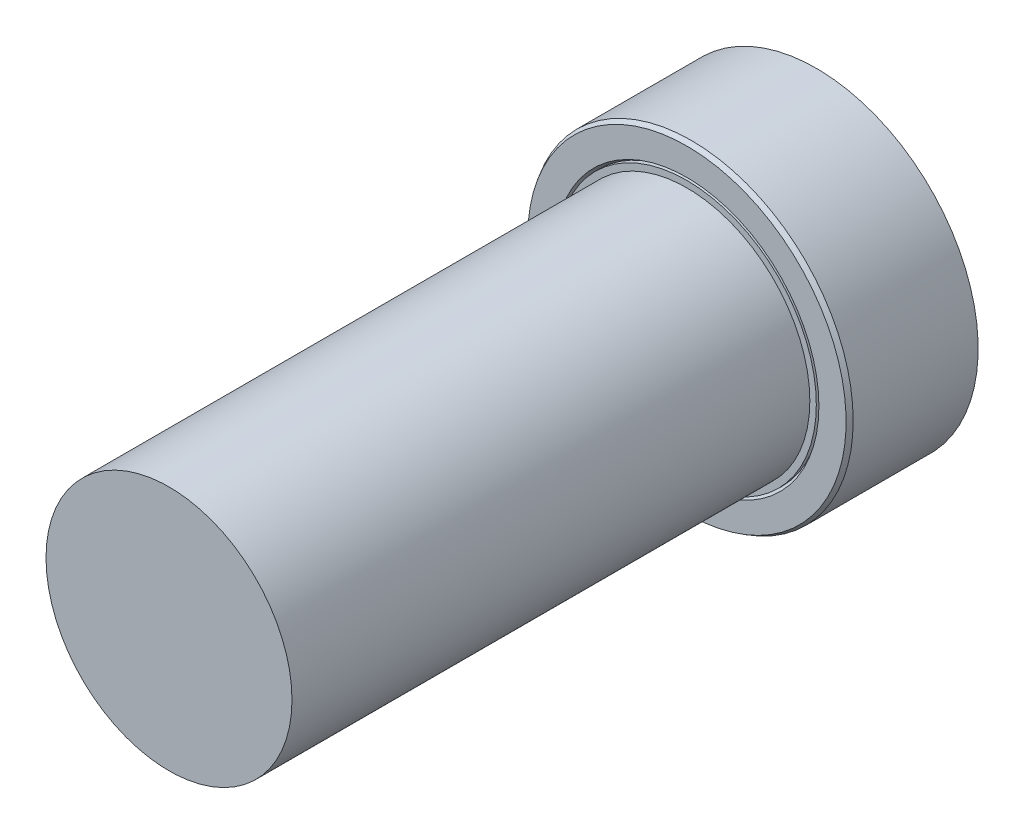
ISO-10303-21;
HEADER;
FILE_DESCRIPTION(('STEP AP214'),'2;1');
FILE_NAME('part.step','',(''),(''),'','','');
FILE_SCHEMA(('AUTOMOTIVE_DESIGN { 1 0 10303 214 1 1 1 1 }'));
ENDSEC;
DATA;
#1=APPLICATION_CONTEXT('core data for automotive mechanical design processes');
#2=APPLICATION_PROTOCOL_DEFINITION('international standard','automotive_design',2000,#1);
#3=PRODUCT_CONTEXT('',#1,'mechanical');
#4=PRODUCT('Part','Part','',(#3));
#5=PRODUCT_RELATED_PRODUCT_CATEGORY('part','',(#4));
#6=PRODUCT_DEFINITION_FORMATION('','',#4);
#7=PRODUCT_DEFINITION_CONTEXT('part definition',#1,'design');
#8=PRODUCT_DEFINITION('design','',#6,#7);
#9=PRODUCT_DEFINITION_SHAPE('','',#8);
#10=(LENGTH_UNIT() NAMED_UNIT(*) SI_UNIT(.MILLI.,.METRE.));
#11=(NAMED_UNIT(*) PLANE_ANGLE_UNIT() SI_UNIT($,.RADIAN.));
#12=(NAMED_UNIT(*) SI_UNIT($,.STERADIAN.) SOLID_ANGLE_UNIT());
#13=UNCERTAINTY_MEASURE_WITH_UNIT(LENGTH_MEASURE(1.E-05),#10,'distance_accuracy_value','');
#14=(GEOMETRIC_REPRESENTATION_CONTEXT(3) GLOBAL_UNCERTAINTY_ASSIGNED_CONTEXT((#13)) GLOBAL_UNIT_ASSIGNED_CONTEXT((#10,
#11,#12)) REPRESENTATION_CONTEXT('',''));
#15=CARTESIAN_POINT('',(0.,0.,0.));
#16=DIRECTION('',(0.,0.,1.));
#17=DIRECTION('',(1.,0.,0.));
#18=AXIS2_PLACEMENT_3D('',#15,#16,#17);
#19=CARTESIAN_POINT('',(0.,0.,1.22591498133671));
#20=DIRECTION('',(0.,0.,-1.));
#21=DIRECTION('',(-1.,0.,0.));
#22=AXIS2_PLACEMENT_3D('',#19,#20,#21);
#23=PLANE('',#22);
#24=CARTESIAN_POINT('',(0.,0.,1.22591498133671));
#25=DIRECTION('',(0.,0.,-1.));
#26=DIRECTION('',(-1.,0.,0.));
#27=AXIS2_PLACEMENT_3D('',#24,#25,#26);
#28=CIRCLE('',#27,6.25);
#29=CARTESIAN_POINT('',(-6.25,0.,1.22591498133671));
#30=VERTEX_POINT('',#29);
#31=EDGE_CURVE('E39',#30,#30,#28,.F.);
#32=ORIENTED_EDGE('',*,*,#31,.F.);
#33=EDGE_LOOP('',(#32));
#34=FACE_BOUND('',#33,.T.);
#35=ADVANCED_FACE('F36',(#34),#23,.T.);
#36=CARTESIAN_POINT('',(0.,0.,6.47591498133671));
#37=DIRECTION('',(0.,0.,-1.));
#38=DIRECTION('',(-1.,0.,0.));
#39=AXIS2_PLACEMENT_3D('',#36,#37,#38);
#40=CYLINDRICAL_SURFACE('',#39,6.25);
#41=ORIENTED_EDGE('',*,*,#31,.T.);
#42=EDGE_LOOP('',(#41));
#43=FACE_BOUND('',#42,.T.);
#44=CARTESIAN_POINT('',(0.,0.,6.0527099005798));
#45=DIRECTION('',(0.,0.,-1.));
#46=DIRECTION('',(1.,0.,0.));
#47=AXIS2_PLACEMENT_3D('',#44,#45,#46);
#48=CIRCLE('',#47,6.24999999999999);
#49=CARTESIAN_POINT('',(6.24999999999999,0.,6.0527099005798));
#50=VERTEX_POINT('',#49);
#51=EDGE_CURVE('E51',#50,#50,#48,.F.);
#52=ORIENTED_EDGE('',*,*,#51,.F.);
#53=EDGE_LOOP('',(#52));
#54=FACE_BOUND('',#53,.T.);
#55=ADVANCED_FACE('F69',(#43,#54),#40,.T.);
#56=CARTESIAN_POINT('',(0.,0.,6.0527099005798));
#57=DIRECTION('',(0.,0.,-1.));
#58=DIRECTION('',(-1.,0.,0.));
#59=AXIS2_PLACEMENT_3D('',#56,#57,#58);
#60=CONICAL_SURFACE('',#59,6.25,0.5235987755982);
#61=ORIENTED_EDGE('',*,*,#51,.T.);
#62=EDGE_LOOP('',(#61));
#63=FACE_BOUND('',#62,.T.);
#64=CARTESIAN_POINT('',(0.,0.,6.22591498133671));
#65=DIRECTION('',(0.,0.,-1.));
#66=DIRECTION('',(-1.,0.,0.));
#67=AXIS2_PLACEMENT_3D('',#64,#65,#66);
#68=CIRCLE('',#67,6.15000000000001);
#69=CARTESIAN_POINT('',(-6.15000000000001,0.,6.22591498133671));
#70=VERTEX_POINT('',#69);
#71=EDGE_CURVE('E59',#70,#70,#68,.T.);
#72=ORIENTED_EDGE('',*,*,#71,.T.);
#73=EDGE_LOOP('',(#72));
#74=FACE_BOUND('',#73,.T.);
#75=ADVANCED_FACE('F76',(#63,#74),#60,.T.);
#76=CARTESIAN_POINT('',(0.,0.,6.22591498133671));
#77=DIRECTION('',(0.,0.,-1.));
#78=DIRECTION('',(-1.,0.,0.));
#79=AXIS2_PLACEMENT_3D('',#76,#77,#78);
#80=PLANE('',#79);
#81=CARTESIAN_POINT('',(0.,0.,6.22591498133671));
#82=DIRECTION('',(0.,0.,1.));
#83=DIRECTION('',(1.,0.,0.));
#84=AXIS2_PLACEMENT_3D('',#81,#82,#83);
#85=CIRCLE('',#84,5.09999999999999);
#86=CARTESIAN_POINT('',(5.09999999999999,0.,6.22591498133671));
#87=VERTEX_POINT('',#86);
#88=EDGE_CURVE('E57',#87,#87,#85,.F.);
#89=ORIENTED_EDGE('',*,*,#88,.T.);
#90=EDGE_LOOP('',(#89));
#91=FACE_BOUND('',#90,.T.);
#92=ORIENTED_EDGE('',*,*,#71,.F.);
#93=EDGE_LOOP('',(#92));
#94=FACE_BOUND('',#93,.T.);
#95=ADVANCED_FACE('F99',(#91,#94),#80,.F.);
#96=CARTESIAN_POINT('',(0.,0.,6.22591498133671));
#97=DIRECTION('',(0.,0.,1.));
#98=DIRECTION('',(1.,0.,0.));
#99=AXIS2_PLACEMENT_3D('',#96,#97,#98);
#100=CONICAL_SURFACE('',#99,5.09999999999999,0.523598775598199);
#101=ORIENTED_EDGE('',*,*,#88,.F.);
#102=EDGE_LOOP('',(#101));
#103=FACE_BOUND('',#102,.T.);
#104=CARTESIAN_POINT('',(0.,0.,6.05270990057986));
#105=DIRECTION('',(0.,0.,-1.));
#106=DIRECTION('',(-1.,0.,0.));
#107=AXIS2_PLACEMENT_3D('',#104,#105,#106);
#108=CIRCLE('',#107,5.);
#109=CARTESIAN_POINT('',(-5.,0.,6.05270990057986));
#110=VERTEX_POINT('',#109);
#111=EDGE_CURVE('E56',#110,#110,#108,.F.);
#112=ORIENTED_EDGE('',*,*,#111,.F.);
#113=EDGE_LOOP('',(#112));
#114=FACE_BOUND('',#113,.T.);
#115=ADVANCED_FACE('F95',(#103,#114),#100,.F.);
#116=CARTESIAN_POINT('',(0.,0.,27.4759149813367));
#117=DIRECTION('',(0.,0.,-1.));
#118=DIRECTION('',(-1.,0.,0.));
#119=AXIS2_PLACEMENT_3D('',#116,#117,#118);
#120=CYLINDRICAL_SURFACE('',#119,5.);
#121=CARTESIAN_POINT('',(0.,0.,6.22591498133671));
#122=DIRECTION('',(0.,0.,-1.));
#123=DIRECTION('',(-1.,0.,0.));
#124=AXIS2_PLACEMENT_3D('',#121,#122,#123);
#125=CIRCLE('',#124,5.);
#126=CARTESIAN_POINT('',(-5.,0.,6.22591498133671));
#127=VERTEX_POINT('',#126);
#128=EDGE_CURVE('E48',#127,#127,#125,.T.);
#129=ORIENTED_EDGE('',*,*,#128,.T.);
#130=EDGE_LOOP('',(#129));
#131=FACE_BOUND('',#130,.T.);
#132=ORIENTED_EDGE('',*,*,#111,.T.);
#133=EDGE_LOOP('',(#132));
#134=FACE_BOUND('',#133,.T.);
#135=ADVANCED_FACE('F91',(#131,#134),#120,.T.);
#136=CARTESIAN_POINT('',(0.,0.,6.22591498133671));
#137=DIRECTION('',(0.,0.,-1.));
#138=DIRECTION('',(-1.,0.,0.));
#139=AXIS2_PLACEMENT_3D('',#136,#137,#138);
#140=PLANE('',#139);
#141=CARTESIAN_POINT('',(0.,0.,6.22591498133671));
#142=DIRECTION('',(0.,0.,-1.));
#143=DIRECTION('',(-1.,0.,0.));
#144=AXIS2_PLACEMENT_3D('',#141,#142,#143);
#145=CIRCLE('',#144,4.75);
#146=CARTESIAN_POINT('',(-4.75,0.,6.22591498133671));
#147=VERTEX_POINT('',#146);
#148=EDGE_CURVE('E43',#147,#147,#145,.F.);
#149=ORIENTED_EDGE('',*,*,#148,.F.);
#150=EDGE_LOOP('',(#149));
#151=FACE_BOUND('',#150,.T.);
#152=ORIENTED_EDGE('',*,*,#128,.F.);
#153=EDGE_LOOP('',(#152));
#154=FACE_BOUND('',#153,.T.);
#155=ADVANCED_FACE('F84',(#151,#154),#140,.F.);
#156=CARTESIAN_POINT('',(0.,0.,26.2259149813367));
#157=DIRECTION('',(0.,0.,-1.));
#158=DIRECTION('',(-1.,0.,0.));
#159=AXIS2_PLACEMENT_3D('',#156,#157,#158);
#160=PLANE('',#159);
#161=CARTESIAN_POINT('',(0.,0.,26.2259149813367));
#162=DIRECTION('',(0.,0.,-1.));
#163=DIRECTION('',(-1.,0.,0.));
#164=AXIS2_PLACEMENT_3D('',#161,#162,#163);
#165=CIRCLE('',#164,4.75);
#166=CARTESIAN_POINT('',(-4.75,0.,26.2259149813367));
#167=VERTEX_POINT('',#166);
#168=EDGE_CURVE('E10',#167,#167,#165,.T.);
#169=ORIENTED_EDGE('',*,*,#168,.F.);
#170=EDGE_LOOP('',(#169));
#171=FACE_BOUND('',#170,.T.);
#172=ADVANCED_FACE('F79',(#171),#160,.F.);
#173=CARTESIAN_POINT('',(0.,0.,27.4759149813367));
#174=DIRECTION('',(0.,0.,-1.));
#175=DIRECTION('',(-1.,0.,0.));
#176=AXIS2_PLACEMENT_3D('',#173,#174,#175);
#177=CYLINDRICAL_SURFACE('',#176,4.75);
#178=ORIENTED_EDGE('',*,*,#168,.T.);
#179=EDGE_LOOP('',(#178));
#180=FACE_BOUND('',#179,.T.);
#181=ORIENTED_EDGE('',*,*,#148,.T.);
#182=EDGE_LOOP('',(#181));
#183=FACE_BOUND('',#182,.T.);
#184=ADVANCED_FACE('F77',(#180,#183),#177,.T.);
#185=CLOSED_SHELL('',(#35,#55,#75,#95,#115,#135,#155,#172,#184));
#186=MANIFOLD_SOLID_BREP('B2',#185);
#187=ADVANCED_BREP_SHAPE_REPRESENTATION('',(#18,#186),#14);
#188=SHAPE_DEFINITION_REPRESENTATION(#9,#187);
ENDSEC;
END-ISO-10303-21;
